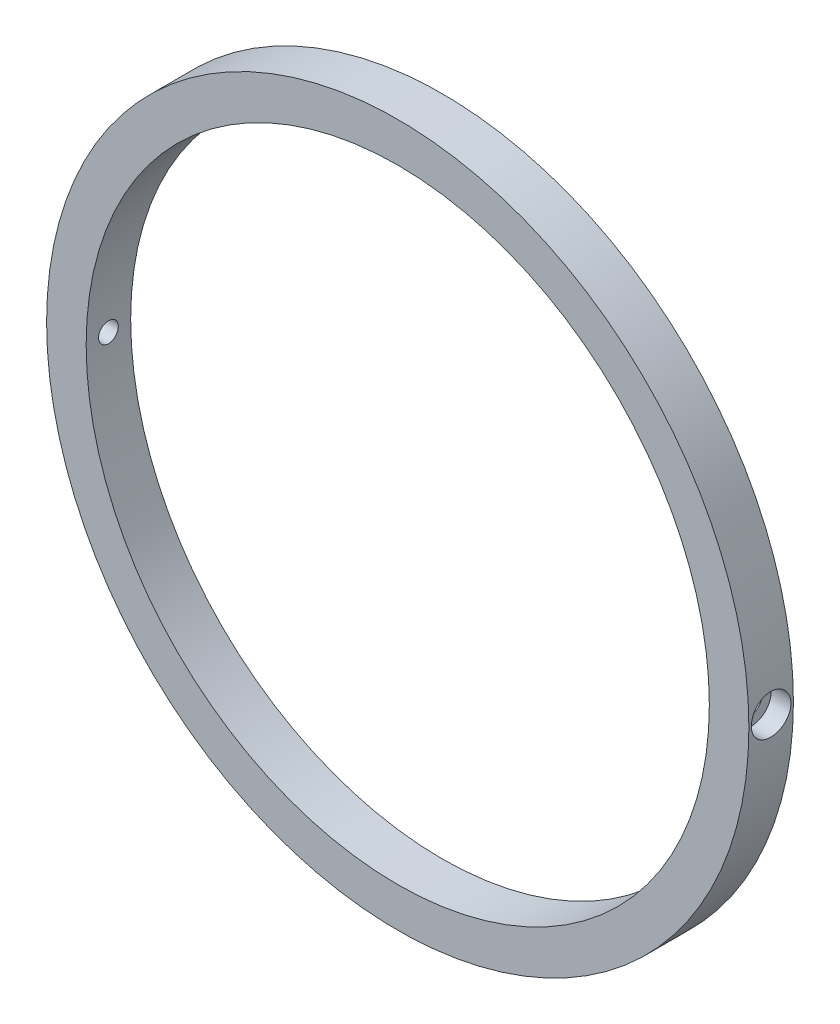
ISO-10303-21;
HEADER;
FILE_DESCRIPTION(('STEP AP214'),'2;1');
FILE_NAME('part.step','',(''),(''),'','','');
FILE_SCHEMA(('AUTOMOTIVE_DESIGN { 1 0 10303 214 1 1 1 1 }'));
ENDSEC;
DATA;
#1=APPLICATION_CONTEXT('core data for automotive mechanical design processes');
#2=APPLICATION_PROTOCOL_DEFINITION('international standard','automotive_design',2000,#1);
#3=PRODUCT_CONTEXT('',#1,'mechanical');
#4=PRODUCT('Part','Part','',(#3));
#5=PRODUCT_RELATED_PRODUCT_CATEGORY('part','',(#4));
#6=PRODUCT_DEFINITION_FORMATION('','',#4);
#7=PRODUCT_DEFINITION_CONTEXT('part definition',#1,'design');
#8=PRODUCT_DEFINITION('design','',#6,#7);
#9=PRODUCT_DEFINITION_SHAPE('','',#8);
#10=(LENGTH_UNIT() NAMED_UNIT(*) SI_UNIT(.MILLI.,.METRE.));
#11=(NAMED_UNIT(*) PLANE_ANGLE_UNIT() SI_UNIT($,.RADIAN.));
#12=(NAMED_UNIT(*) SI_UNIT($,.STERADIAN.) SOLID_ANGLE_UNIT());
#13=UNCERTAINTY_MEASURE_WITH_UNIT(LENGTH_MEASURE(1.E-05),#10,'distance_accuracy_value','');
#14=(GEOMETRIC_REPRESENTATION_CONTEXT(3) GLOBAL_UNCERTAINTY_ASSIGNED_CONTEXT((#13)) GLOBAL_UNIT_ASSIGNED_CONTEXT((#10,
#11,#12)) REPRESENTATION_CONTEXT('',''));
#15=CARTESIAN_POINT('',(0.,0.,0.));
#16=DIRECTION('',(0.,0.,1.));
#17=DIRECTION('',(1.,0.,0.));
#18=AXIS2_PLACEMENT_3D('',#15,#16,#17);
#19=CARTESIAN_POINT('',(0.,0.,3.571875));
#20=DIRECTION('',(0.,0.,1.));
#21=DIRECTION('',(1.,0.,0.));
#22=AXIS2_PLACEMENT_3D('',#19,#20,#21);
#23=PLANE('',#22);
#24=CARTESIAN_POINT('',(0.,0.,3.571875));
#25=DIRECTION('',(0.,0.,1.));
#26=DIRECTION('',(1.,0.,0.));
#27=AXIS2_PLACEMENT_3D('',#24,#25,#26);
#28=CIRCLE('',#27,56.35625);
#29=CARTESIAN_POINT('',(56.35625,0.,3.571875));
#30=VERTEX_POINT('',#29);
#31=EDGE_CURVE('E48',#30,#30,#28,.T.);
#32=ORIENTED_EDGE('',*,*,#31,.T.);
#33=EDGE_LOOP('',(#32));
#34=FACE_BOUND('',#33,.T.);
#35=CARTESIAN_POINT('',(0.,0.,3.571875));
#36=DIRECTION('',(0.,0.,1.));
#37=DIRECTION('',(1.,0.,0.));
#38=AXIS2_PLACEMENT_3D('',#35,#36,#37);
#39=CIRCLE('',#38,50.00625);
#40=CARTESIAN_POINT('',(50.00625,0.,3.571875));
#41=VERTEX_POINT('',#40);
#42=EDGE_CURVE('E85',#41,#41,#39,.T.);
#43=ORIENTED_EDGE('',*,*,#42,.F.);
#44=EDGE_LOOP('',(#43));
#45=FACE_BOUND('',#44,.T.);
#46=ADVANCED_FACE('F31',(#34,#45),#23,.T.);
#47=CARTESIAN_POINT('',(0.,0.,-3.571875));
#48=DIRECTION('',(0.,0.,1.));
#49=DIRECTION('',(1.,0.,0.));
#50=AXIS2_PLACEMENT_3D('',#47,#48,#49);
#51=PLANE('',#50);
#52=CARTESIAN_POINT('',(0.,0.,-3.571875));
#53=DIRECTION('',(0.,0.,1.));
#54=DIRECTION('',(1.,0.,0.));
#55=AXIS2_PLACEMENT_3D('',#52,#53,#54);
#56=CIRCLE('',#55,56.35625);
#57=CARTESIAN_POINT('',(56.35625,0.,-3.571875));
#58=VERTEX_POINT('',#57);
#59=EDGE_CURVE('E82',#58,#58,#56,.T.);
#60=ORIENTED_EDGE('',*,*,#59,.F.);
#61=EDGE_LOOP('',(#60));
#62=FACE_BOUND('',#61,.T.);
#63=CARTESIAN_POINT('',(0.,0.,-3.571875));
#64=DIRECTION('',(0.,0.,1.));
#65=DIRECTION('',(1.,0.,0.));
#66=AXIS2_PLACEMENT_3D('',#63,#64,#65);
#67=CIRCLE('',#66,50.00625);
#68=CARTESIAN_POINT('',(50.00625,0.,-3.571875));
#69=VERTEX_POINT('',#68);
#70=EDGE_CURVE('E88',#69,#69,#67,.T.);
#71=ORIENTED_EDGE('',*,*,#70,.T.);
#72=EDGE_LOOP('',(#71));
#73=FACE_BOUND('',#72,.T.);
#74=ADVANCED_FACE('F121',(#62,#73),#51,.F.);
#75=CARTESIAN_POINT('',(0.,0.,3.571875));
#76=DIRECTION('',(0.,0.,-1.));
#77=DIRECTION('',(-1.,0.,0.));
#78=AXIS2_PLACEMENT_3D('',#75,#76,#77);
#79=CYLINDRICAL_SURFACE('',#78,56.35625);
#80=CARTESIAN_POINT('',(-56.35625,0.,3.17500000000001));
#81=CARTESIAN_POINT('',(-56.3562488070639,-0.17818949688881,3.17499214710165));
#82=CARTESIAN_POINT('',(-56.3553958449006,-0.356504594019408,3.15994889918972));
#83=CARTESIAN_POINT('',(-56.3520752111119,-0.708213500618105,3.10015297713375));
#84=CARTESIAN_POINT('',(-56.3496056481155,-0.881601297065028,3.05536550230864));
#85=CARTESIAN_POINT('',(-56.3433312590257,-1.21831000970454,2.93736947652098));
#86=CARTESIAN_POINT('',(-56.3395271249721,-1.38163609188037,2.86417565354166));
#87=CARTESIAN_POINT('',(-56.3310117536249,-1.6936403251035,2.69146786978358));
#88=CARTESIAN_POINT('',(-56.3263007274676,-1.84232187343274,2.5919600332376));
#89=CARTESIAN_POINT('',(-56.316494779011,-2.12104498257764,2.36931230344307));
#90=CARTESIAN_POINT('',(-56.3113994426935,-2.25106598983634,2.24614669623539));
#91=CARTESIAN_POINT('',(-56.3014027001805,-2.48860170116661,1.97973193180977));
#92=CARTESIAN_POINT('',(-56.2965013020001,-2.5961154758525,1.83648194566012));
#93=CARTESIAN_POINT('',(-56.287442081059,-2.78564526010597,1.53385207243873));
#94=CARTESIAN_POINT('',(-56.2832847440704,-2.86764463780474,1.37446175343414));
#95=CARTESIAN_POINT('',(-56.276187688188,-3.00371142861824,1.04414899269456));
#96=CARTESIAN_POINT('',(-56.2732479582098,-3.0577790960087,0.873226655957057));
#97=CARTESIAN_POINT('',(-56.2689214846203,-3.13639181844436,0.524895913516286));
#98=CARTESIAN_POINT('',(-56.2675330798786,-3.16096845403026,0.347494656003137));
#99=CARTESIAN_POINT('',(-56.2664608457553,-3.1799989365961,-0.00892036426953428));
#100=CARTESIAN_POINT('',(-56.266777000118,-3.17445307084447,-0.187934111635015));
#101=CARTESIAN_POINT('',(-56.2690766886636,-3.13342222987491,-0.542277659603261));
#102=CARTESIAN_POINT('',(-56.2710583211965,-3.09797140010308,-0.717611428096159));
#103=CARTESIAN_POINT('',(-56.2764626370314,-2.99818988815397,-1.05983549025631));
#104=CARTESIAN_POINT('',(-56.2798853276448,-2.93385905945242,-1.22672574108013));
#105=CARTESIAN_POINT('',(-56.28778820836,-2.77810478046166,-1.54743523158331));
#106=CARTESIAN_POINT('',(-56.2922690043396,-2.68666580018644,-1.70124691350774));
#107=CARTESIAN_POINT('',(-56.301782489324,-2.47930211707277,-1.99135047557495));
#108=CARTESIAN_POINT('',(-56.3068151833311,-2.36337719229236,-2.1276421968978));
#109=CARTESIAN_POINT('',(-56.3168737188484,-2.11013979536505,-2.37903571723353));
#110=CARTESIAN_POINT('',(-56.3218995410553,-1.97279776332888,-2.49410774242748));
#111=CARTESIAN_POINT('',(-56.3313711693687,-1.6807285482427,-2.69956586020243));
#112=CARTESIAN_POINT('',(-56.3358169753058,-1.52600136011524,-2.78995194557369));
#113=CARTESIAN_POINT('',(-56.3436278259713,-1.20353624241053,-2.94346976195979));
#114=CARTESIAN_POINT('',(-56.3469928278114,-1.03579779685028,-3.00660041146258));
#115=CARTESIAN_POINT('',(-56.3522622549028,-0.692079529649505,-3.10379564317917));
#116=CARTESIAN_POINT('',(-56.3541666940222,-0.516099786276848,-3.13786050137269));
#117=CARTESIAN_POINT('',(-56.3562985935364,-0.161152745565784,-3.17592038392399));
#118=CARTESIAN_POINT('',(-56.356528350189,0.0178101236052269,-3.17995658253858));
#119=CARTESIAN_POINT('',(-56.3552910945924,0.373870482459747,-3.15795208695444));
#120=CARTESIAN_POINT('',(-56.3538240894957,0.550967980003289,-3.13191151954004));
#121=CARTESIAN_POINT('',(-56.3493599802967,0.898154778768988,-3.05052677311671));
#122=CARTESIAN_POINT('',(-56.3463638601651,1.06824851087377,-2.9952014377213));
#123=CARTESIAN_POINT('',(-56.3391787231727,1.39673606439549,-2.85683675795837));
#124=CARTESIAN_POINT('',(-56.3349896975863,1.55512980022052,-2.77379721087062));
#125=CARTESIAN_POINT('',(-56.3258840079501,1.85590996160087,-2.58225616645402));
#126=CARTESIAN_POINT('',(-56.3209665586711,1.99827881744892,-2.47372711699269));
#127=CARTESIAN_POINT('',(-56.3109602612623,2.26279113038791,-2.23432799097384));
#128=CARTESIAN_POINT('',(-56.3058714117522,2.38493442454348,-2.10345773445477));
#129=CARTESIAN_POINT('',(-56.2960892696843,2.60566744756069,-1.82291374483621));
#130=CARTESIAN_POINT('',(-56.2913964289456,2.70423050201445,-1.67321900632356));
#131=CARTESIAN_POINT('',(-56.2829426553753,2.8748228240502,-1.35938119563709));
#132=CARTESIAN_POINT('',(-56.2791817176743,2.94685223028114,-1.19523819896677));
#133=CARTESIAN_POINT('',(-56.2730191093007,3.06228624600497,-0.857261443967906));
#134=CARTESIAN_POINT('',(-56.2706166361869,3.10570775661077,-0.683433473334459));
#135=CARTESIAN_POINT('',(-56.2674396411002,3.16274864287058,-0.330940406362341));
#136=CARTESIAN_POINT('',(-56.2666651065766,3.17636824828272,-0.152275347326011));
#137=CARTESIAN_POINT('',(-56.2668316370321,3.17341654410086,0.204554893020812));
#138=CARTESIAN_POINT('',(-56.2677703182951,3.15688718287655,0.382720423963551));
#139=CARTESIAN_POINT('',(-56.2712524490683,3.09419359250235,0.733742356288986));
#140=CARTESIAN_POINT('',(-56.2737959015696,3.0480293081162,0.906598747775395));
#141=CARTESIAN_POINT('',(-56.2802003670135,2.92738534040244,1.24210313435494));
#142=CARTESIAN_POINT('',(-56.2840613814252,2.85290562550359,1.40475111806563));
#143=CARTESIAN_POINT('',(-56.2926657396009,2.67775138994934,1.71523814112231));
#144=CARTESIAN_POINT('',(-56.297409058317,2.57707761289294,1.86307760068882));
#145=CARTESIAN_POINT('',(-56.307251081107,2.35223989204021,2.13996236805013));
#146=CARTESIAN_POINT('',(-56.312350231966,2.22804606856848,2.26898339592115));
#147=CARTESIAN_POINT('',(-56.3223257160214,1.95972545380062,2.50438749642571));
#148=CARTESIAN_POINT('',(-56.3272019942404,1.81559377923535,2.61076500685149));
#149=CARTESIAN_POINT('',(-56.3361864336925,1.51135139323292,2.79792576700227));
#150=CARTESIAN_POINT('',(-56.3402937510033,1.35122341816128,2.87868096336929));
#151=CARTESIAN_POINT('',(-56.3472655200087,1.01977680676596,3.01206245819919));
#152=CARTESIAN_POINT('',(-56.3501314330254,0.848471602698058,3.06472184673471));
#153=CARTESIAN_POINT('',(-56.3535427929704,0.563424852165976,3.12666461907407));
#154=CARTESIAN_POINT('',(-56.3545535100039,0.451527829696537,3.1447671037977));
#155=CARTESIAN_POINT('',(-56.3559074922218,0.226437446906073,3.16893728298837));
#156=CARTESIAN_POINT('',(-56.3562507581421,0.113244088014252,3.17500499072241));
#157=CARTESIAN_POINT('',(-56.35625,0.,3.17500000000001));
#158=B_SPLINE_CURVE_WITH_KNOTS('',3,(#80,#81,#82,#83,#84,#85,#86,#87,#88,#89,#90,#91,#92,#93,
#94,#95,#96,#97,#98,#99,#100,#101,#102,#103,#104,#105,#106,#107,#108,#109,#110,#111,#112,#113,
#114,#115,#116,#117,#118,#119,#120,#121,#122,#123,#124,#125,#126,#127,#128,#129,#130,#131,#132,
#133,#134,#135,#136,#137,#138,#139,#140,#141,#142,#143,#144,#145,#146,#147,#148,#149,#150,#151,
#152,#153,#154,#155,#156,#157),.UNSPECIFIED.,.T.,.F.,(4,2,2,2,2,2,2,2,2,2,2,2,2,2,2,2,2,2,2,2,2,
2,2,2,2,2,2,2,2,2,2,2,2,2,2,2,2,2,4),(0.,0.534155095591571,1.06893625509694,1.6034405135268,
2.13782048259574,2.6727845973948,3.20777079798141,3.74310500872125,4.27843434597141,
4.81318991149801,5.3479403772448,5.88208109080971,6.41622451439748,6.95067453664025,
7.48512940337583,8.0203285623121,8.55552787755746,9.09074842788101,9.62596389622853,
10.1604453601958,10.6949245711406,11.2290602827551,11.7631999014797,12.2979195618366,
12.8326435296388,13.3679695569276,13.9032927868837,14.4382994716859,14.9733020318332,
15.507560773195,16.0418205103599,16.5760808432174,17.1103260111067,17.6452544886477,
18.1803142160465,18.7159577640561,19.2509690529669,19.5904389678501,19.9299085085054),.UNSPECIFIED.);
#159=CARTESIAN_POINT('',(-56.35625,0.,3.17500000000001));
#160=VERTEX_POINT('',#159);
#161=EDGE_CURVE('E10',#160,#160,#158,.T.);
#162=ORIENTED_EDGE('',*,*,#161,.T.);
#163=EDGE_LOOP('',(#162));
#164=FACE_BOUND('',#163,.T.);
#165=CARTESIAN_POINT('',(56.35625,0.,-3.17500000000001));
#166=CARTESIAN_POINT('',(56.3562488070639,-0.17818949688881,-3.17499214710165));
#167=CARTESIAN_POINT('',(56.3553958449006,-0.356504594019408,-3.15994889918972));
#168=CARTESIAN_POINT('',(56.3520752111119,-0.708213500618105,-3.10015297713375));
#169=CARTESIAN_POINT('',(56.3496056481155,-0.881601297065028,-3.05536550230864));
#170=CARTESIAN_POINT('',(56.3433312590257,-1.21831000970454,-2.93736947652098));
#171=CARTESIAN_POINT('',(56.3395271249721,-1.38163609188037,-2.86417565354166));
#172=CARTESIAN_POINT('',(56.3310117536249,-1.6936403251035,-2.69146786978358));
#173=CARTESIAN_POINT('',(56.3263007274676,-1.84232187343274,-2.5919600332376));
#174=CARTESIAN_POINT('',(56.316494779011,-2.12104498257764,-2.36931230344307));
#175=CARTESIAN_POINT('',(56.3113994426935,-2.25106598983634,-2.24614669623539));
#176=CARTESIAN_POINT('',(56.3014027001805,-2.48860170116661,-1.97973193180977));
#177=CARTESIAN_POINT('',(56.2965013020001,-2.5961154758525,-1.83648194566012));
#178=CARTESIAN_POINT('',(56.287442081059,-2.78564526010597,-1.53385207243873));
#179=CARTESIAN_POINT('',(56.2832847440704,-2.86764463780474,-1.37446175343414));
#180=CARTESIAN_POINT('',(56.276187688188,-3.00371142861824,-1.04414899269456));
#181=CARTESIAN_POINT('',(56.2732479582098,-3.0577790960087,-0.873226655957057));
#182=CARTESIAN_POINT('',(56.2689214846203,-3.13639181844436,-0.524895913516286));
#183=CARTESIAN_POINT('',(56.2675330798786,-3.16096845403026,-0.347494656003137));
#184=CARTESIAN_POINT('',(56.2664608457553,-3.1799989365961,0.00892036426953428));
#185=CARTESIAN_POINT('',(56.266777000118,-3.17445307084447,0.187934111635015));
#186=CARTESIAN_POINT('',(56.2690766886636,-3.13342222987491,0.542277659603261));
#187=CARTESIAN_POINT('',(56.2710583211965,-3.09797140010308,0.717611428096159));
#188=CARTESIAN_POINT('',(56.2764626370314,-2.99818988815397,1.05983549025631));
#189=CARTESIAN_POINT('',(56.2798853276448,-2.93385905945242,1.22672574108013));
#190=CARTESIAN_POINT('',(56.28778820836,-2.77810478046166,1.54743523158331));
#191=CARTESIAN_POINT('',(56.2922690043396,-2.68666580018644,1.70124691350774));
#192=CARTESIAN_POINT('',(56.301782489324,-2.47930211707277,1.99135047557495));
#193=CARTESIAN_POINT('',(56.3068151833311,-2.36337719229236,2.1276421968978));
#194=CARTESIAN_POINT('',(56.3168737188484,-2.11013979536505,2.37903571723353));
#195=CARTESIAN_POINT('',(56.3218995410553,-1.97279776332888,2.49410774242748));
#196=CARTESIAN_POINT('',(56.3313711693687,-1.6807285482427,2.69956586020243));
#197=CARTESIAN_POINT('',(56.3358169753058,-1.52600136011524,2.78995194557369));
#198=CARTESIAN_POINT('',(56.3436278259713,-1.20353624241053,2.94346976195979));
#199=CARTESIAN_POINT('',(56.3469928278114,-1.03579779685028,3.00660041146258));
#200=CARTESIAN_POINT('',(56.3522622549028,-0.692079529649505,3.10379564317917));
#201=CARTESIAN_POINT('',(56.3541666940222,-0.516099786276848,3.13786050137269));
#202=CARTESIAN_POINT('',(56.3562985935364,-0.161152745565784,3.17592038392399));
#203=CARTESIAN_POINT('',(56.356528350189,0.0178101236052269,3.17995658253858));
#204=CARTESIAN_POINT('',(56.3552910945924,0.373870482459747,3.15795208695444));
#205=CARTESIAN_POINT('',(56.3538240894957,0.550967980003289,3.13191151954004));
#206=CARTESIAN_POINT('',(56.3493599802967,0.898154778768988,3.05052677311671));
#207=CARTESIAN_POINT('',(56.3463638601651,1.06824851087377,2.9952014377213));
#208=CARTESIAN_POINT('',(56.3391787231727,1.39673606439549,2.85683675795837));
#209=CARTESIAN_POINT('',(56.3349896975863,1.55512980022052,2.77379721087062));
#210=CARTESIAN_POINT('',(56.3258840079501,1.85590996160087,2.58225616645402));
#211=CARTESIAN_POINT('',(56.3209665586711,1.99827881744892,2.47372711699269));
#212=CARTESIAN_POINT('',(56.3109602612623,2.26279113038791,2.23432799097384));
#213=CARTESIAN_POINT('',(56.3058714117522,2.38493442454348,2.10345773445477));
#214=CARTESIAN_POINT('',(56.2960892696843,2.60566744756069,1.82291374483621));
#215=CARTESIAN_POINT('',(56.2913964289456,2.70423050201445,1.67321900632356));
#216=CARTESIAN_POINT('',(56.2829426553753,2.8748228240502,1.35938119563709));
#217=CARTESIAN_POINT('',(56.2791817176743,2.94685223028114,1.19523819896677));
#218=CARTESIAN_POINT('',(56.2730191093007,3.06228624600497,0.857261443967906));
#219=CARTESIAN_POINT('',(56.2706166361869,3.10570775661077,0.683433473334459));
#220=CARTESIAN_POINT('',(56.2674396411002,3.16274864287058,0.330940406362341));
#221=CARTESIAN_POINT('',(56.2666651065766,3.17636824828272,0.152275347326011));
#222=CARTESIAN_POINT('',(56.2668316370321,3.17341654410086,-0.204554893020812));
#223=CARTESIAN_POINT('',(56.2677703182951,3.15688718287655,-0.382720423963551));
#224=CARTESIAN_POINT('',(56.2712524490683,3.09419359250235,-0.733742356288986));
#225=CARTESIAN_POINT('',(56.2737959015696,3.0480293081162,-0.906598747775395));
#226=CARTESIAN_POINT('',(56.2802003670135,2.92738534040244,-1.24210313435494));
#227=CARTESIAN_POINT('',(56.2840613814252,2.85290562550359,-1.40475111806563));
#228=CARTESIAN_POINT('',(56.2926657396009,2.67775138994934,-1.71523814112231));
#229=CARTESIAN_POINT('',(56.297409058317,2.57707761289294,-1.86307760068882));
#230=CARTESIAN_POINT('',(56.307251081107,2.35223989204021,-2.13996236805013));
#231=CARTESIAN_POINT('',(56.312350231966,2.22804606856848,-2.26898339592115));
#232=CARTESIAN_POINT('',(56.3223257160214,1.95972545380062,-2.50438749642571));
#233=CARTESIAN_POINT('',(56.3272019942404,1.81559377923535,-2.61076500685149));
#234=CARTESIAN_POINT('',(56.3361864336925,1.51135139323292,-2.79792576700227));
#235=CARTESIAN_POINT('',(56.3402937510033,1.35122341816128,-2.87868096336929));
#236=CARTESIAN_POINT('',(56.3472655200087,1.01977680676596,-3.01206245819919));
#237=CARTESIAN_POINT('',(56.3501314330254,0.848471602698058,-3.06472184673471));
#238=CARTESIAN_POINT('',(56.3535427929704,0.563424852165976,-3.12666461907407));
#239=CARTESIAN_POINT('',(56.3545535100039,0.451527829696537,-3.1447671037977));
#240=CARTESIAN_POINT('',(56.3559074922218,0.226437446906073,-3.16893728298837));
#241=CARTESIAN_POINT('',(56.3562507581421,0.113244088014252,-3.17500499072241));
#242=CARTESIAN_POINT('',(56.35625,0.,-3.17500000000001));
#243=B_SPLINE_CURVE_WITH_KNOTS('',3,(#165,#166,#167,#168,#169,#170,#171,#172,#173,#174,#175,
#176,#177,#178,#179,#180,#181,#182,#183,#184,#185,#186,#187,#188,#189,#190,#191,#192,#193,#194,
#195,#196,#197,#198,#199,#200,#201,#202,#203,#204,#205,#206,#207,#208,#209,#210,#211,#212,#213,
#214,#215,#216,#217,#218,#219,#220,#221,#222,#223,#224,#225,#226,#227,#228,#229,#230,#231,#232,
#233,#234,#235,#236,#237,#238,#239,#240,#241,#242),.UNSPECIFIED.,.T.,.F.,(4,2,2,2,2,2,2,2,2,2,2,
2,2,2,2,2,2,2,2,2,2,2,2,2,2,2,2,2,2,2,2,2,2,2,2,2,2,2,4),(0.,0.534155095591571,1.06893625509694,
1.6034405135268,2.13782048259574,2.6727845973948,3.20777079798141,3.74310500872125,
4.27843434597141,4.81318991149801,5.3479403772448,5.88208109080971,6.41622451439748,
6.95067453664025,7.48512940337583,8.0203285623121,8.55552787755746,9.09074842788101,
9.62596389622853,10.1604453601958,10.6949245711406,11.2290602827551,11.7631999014797,
12.2979195618366,12.8326435296388,13.3679695569276,13.9032927868837,14.4382994716859,
14.9733020318332,15.507560773195,16.0418205103599,16.5760808432174,17.1103260111067,
17.6452544886477,18.1803142160465,18.7159577640561,19.2509690529669,19.5904389678501,
19.9299085085054),.UNSPECIFIED.);
#244=CARTESIAN_POINT('',(56.35625,0.,-3.17500000000001));
#245=VERTEX_POINT('',#244);
#246=EDGE_CURVE('E44',#245,#245,#243,.T.);
#247=ORIENTED_EDGE('',*,*,#246,.T.);
#248=EDGE_LOOP('',(#247));
#249=FACE_BOUND('',#248,.T.);
#250=ORIENTED_EDGE('',*,*,#31,.F.);
#251=EDGE_LOOP('',(#250));
#252=FACE_BOUND('',#251,.T.);
#253=ORIENTED_EDGE('',*,*,#59,.T.);
#254=EDGE_LOOP('',(#253));
#255=FACE_BOUND('',#254,.T.);
#256=ADVANCED_FACE('F33',(#164,#249,#252,#255),#79,.T.);
#257=CARTESIAN_POINT('',(0.,0.,3.571875));
#258=DIRECTION('',(0.,0.,-1.));
#259=DIRECTION('',(-1.,0.,0.));
#260=AXIS2_PLACEMENT_3D('',#257,#258,#259);
#261=CYLINDRICAL_SURFACE('',#260,50.00625);
#262=CARTESIAN_POINT('',(-50.00625,0.,1.58750000000001));
#263=CARTESIAN_POINT('',(-50.0062496606678,-0.0891464758756064,1.58749605411074));
#264=CARTESIAN_POINT('',(-50.0060090599656,-0.17835701947236,1.57996572864602));
#265=CARTESIAN_POINT('',(-50.0050723859316,-0.354319549300116,1.55003118905528));
#266=CARTESIAN_POINT('',(-50.0043757690484,-0.441068472478699,1.5276092242779));
#267=CARTESIAN_POINT('',(-50.0026059496477,-0.609533149037438,1.46853183352871));
#268=CARTESIAN_POINT('',(-50.001532931897,-0.691251348794443,1.43188339007926));
#269=CARTESIAN_POINT('',(-49.9991313322757,-0.847352879093743,1.34540342077517));
#270=CARTESIAN_POINT('',(-49.9978028126741,-0.921737990137952,1.29557510591914));
#271=CARTESIAN_POINT('',(-49.9950390565054,-1.06112135523349,1.18412120966111));
#272=CARTESIAN_POINT('',(-49.9936037754418,-1.1261156617734,1.12249069226137));
#273=CARTESIAN_POINT('',(-49.990788652989,-1.24483920456133,0.989190633561183));
#274=CARTESIAN_POINT('',(-49.9894088138132,-1.29856799139625,0.917520691950196));
#275=CARTESIAN_POINT('',(-49.9868599423832,-1.39324215090916,0.76616073814534));
#276=CARTESIAN_POINT('',(-49.9856909508258,-1.4341850568338,0.686469182274863));
#277=CARTESIAN_POINT('',(-49.983696024334,-1.50210921825029,0.5213391345159));
#278=CARTESIAN_POINT('',(-49.9828700879411,-1.52909053310219,0.435900667063115));
#279=CARTESIAN_POINT('',(-49.9816547380432,-1.5683168605707,0.26173278865917));
#280=CARTESIAN_POINT('',(-49.9812651763856,-1.58056687468321,0.173004505202146));
#281=CARTESIAN_POINT('',(-49.9809660556091,-1.58999827746116,-0.00524987483905296));
#282=CARTESIAN_POINT('',(-49.981056494448,-1.58717973023571,-0.094775968027332));
#283=CARTESIAN_POINT('',(-49.9817070381154,-1.56655823993009,-0.272050716584522));
#284=CARTESIAN_POINT('',(-49.9822669734946,-1.54876070301428,-0.359800001533351));
#285=CARTESIAN_POINT('',(-49.9837931228936,-1.49869480387451,-0.53106470959484));
#286=CARTESIAN_POINT('',(-49.9847593378633,-1.46642640781424,-0.614580122807193));
#287=CARTESIAN_POINT('',(-49.9869893227469,-1.38832857064622,-0.775023782349933));
#288=CARTESIAN_POINT('',(-49.9882531470025,-1.34249665251613,-0.851950822174746));
#289=CARTESIAN_POINT('',(-49.9909358244751,-1.23857461024007,-0.997020820813465));
#290=CARTESIAN_POINT('',(-49.992354678096,-1.18048445414088,-1.06516375672935));
#291=CARTESIAN_POINT('',(-49.9951882233423,-1.05366432677087,-1.19076271066185));
#292=CARTESIAN_POINT('',(-49.9966029128529,-0.984929668108263,-1.24821399586668));
#293=CARTESIAN_POINT('',(-49.9992680489337,-0.838788195945105,-1.35076237038462));
#294=CARTESIAN_POINT('',(-50.0005184954764,-0.761381380999442,-1.39585945763904));
#295=CARTESIAN_POINT('',(-50.0027142083498,-0.600090261827105,-1.47241876557773));
#296=CARTESIAN_POINT('',(-50.0036594713251,-0.516205886396874,-1.50388083635609));
#297=CARTESIAN_POINT('',(-50.0051382094865,-0.344342014317202,-1.55227398802325));
#298=CARTESIAN_POINT('',(-50.0056716859257,-0.256362530129728,-1.56920511312862));
#299=CARTESIAN_POINT('',(-50.0062665556241,-0.0788469888931259,-1.5880499573177));
#300=CARTESIAN_POINT('',(-50.0063281547373,0.0106883723253743,-1.58997022481634));
#301=CARTESIAN_POINT('',(-50.0059728715501,0.188810192321874,-1.57875591082616));
#302=CARTESIAN_POINT('',(-50.0055559898733,0.277396652336449,-1.56562134895871));
#303=CARTESIAN_POINT('',(-50.0042908589417,0.45108775043896,-1.52467563923256));
#304=CARTESIAN_POINT('',(-50.0034426971098,0.536193090392839,-1.49686746575152));
#305=CARTESIAN_POINT('',(-50.0014105752657,0.700527663257228,-1.42736692592976));
#306=CARTESIAN_POINT('',(-50.0002266144938,0.779756882871417,-1.38567452817339));
#307=CARTESIAN_POINT('',(-49.9976557441868,0.93012031629183,-1.28957218283098));
#308=CARTESIAN_POINT('',(-49.9962687644039,1.00125171291853,-1.23515782934191));
#309=CARTESIAN_POINT('',(-49.9934483953353,1.13337204100328,-1.115162665653));
#310=CARTESIAN_POINT('',(-49.992015005919,1.19436094391871,-1.0495818240299));
#311=CARTESIAN_POINT('',(-49.9892628198659,1.30448690664614,-0.909087219149338));
#312=CARTESIAN_POINT('',(-49.9879440641987,1.35361974019289,-0.834170142245608));
#313=CARTESIAN_POINT('',(-49.9855704760149,1.43860996686264,-0.677146589295761));
#314=CARTESIAN_POINT('',(-49.9845156428662,1.47446739178231,-0.595040130469917));
#315=CARTESIAN_POINT('',(-49.9827891240416,1.53188153805616,-0.425984410056498));
#316=CARTESIAN_POINT('',(-49.9821173651733,1.55344099139532,-0.339036077073699));
#317=CARTESIAN_POINT('',(-49.981232529399,1.58165615507506,-0.162751609297307));
#318=CARTESIAN_POINT('',(-49.9810194519416,1.58831188333305,-0.0734154773744828));
#319=CARTESIAN_POINT('',(-49.9810760294393,1.5865303523533,0.105066386137394));
#320=CARTESIAN_POINT('',(-49.9813454712691,1.57809975663334,0.194212184383915));
#321=CARTESIAN_POINT('',(-49.9823362649838,1.54639860208068,0.369822394692191));
#322=CARTESIAN_POINT('',(-49.9830576177626,1.52312801389155,0.45628680144927));
#323=CARTESIAN_POINT('',(-49.9848708815458,1.46240842148503,0.624082206364002));
#324=CARTESIAN_POINT('',(-49.9859627985938,1.4249591860231,0.705413120772483));
#325=CARTESIAN_POINT('',(-49.9883940533906,1.33694745543663,0.860631803192841));
#326=CARTESIAN_POINT('',(-49.9897333822831,1.2863854296674,0.934519837481553));
#327=CARTESIAN_POINT('',(-49.9925090890204,1.17356307667012,1.07278640406187));
#328=CARTESIAN_POINT('',(-49.993945499228,1.11129883597633,1.13716174220688));
#329=CARTESIAN_POINT('',(-49.9967534718495,0.976828440012258,1.25456346757841));
#330=CARTESIAN_POINT('',(-49.9981250181254,0.904619827900184,1.30758704195943));
#331=CARTESIAN_POINT('',(-50.0006491657392,0.752280281347614,1.40079015412929));
#332=CARTESIAN_POINT('',(-50.0018016200137,0.672144080059608,1.44096107695945));
#333=CARTESIAN_POINT('',(-50.0037550857224,0.506322845803257,1.50723171466333));
#334=CARTESIAN_POINT('',(-50.0045565157613,0.420644562673647,1.5333481983386));
#335=CARTESIAN_POINT('',(-50.0055035840054,0.278688046319331,1.56385225875828));
#336=CARTESIAN_POINT('',(-50.0057822744526,0.223331099898494,1.57270899252512));
#337=CARTESIAN_POINT('',(-50.0061555890159,0.111991198575292,1.58453410171809));
#338=CARTESIAN_POINT('',(-50.0062502131929,0.0560082438800253,1.58750247909216));
#339=CARTESIAN_POINT('',(-50.00625,0.,1.58750000000001));
#340=B_SPLINE_CURVE_WITH_KNOTS('',3,(#262,#263,#264,#265,#266,#267,#268,#269,#270,#271,#272,
#273,#274,#275,#276,#277,#278,#279,#280,#281,#282,#283,#284,#285,#286,#287,#288,#289,#290,#291,
#292,#293,#294,#295,#296,#297,#298,#299,#300,#301,#302,#303,#304,#305,#306,#307,#308,#309,#310,
#311,#312,#313,#314,#315,#316,#317,#318,#319,#320,#321,#322,#323,#324,#325,#326,#327,#328,#329,
#330,#331,#332,#333,#334,#335,#336,#337,#338,#339),.UNSPECIFIED.,.T.,.F.,(4,2,2,2,2,2,2,2,2,2,2,
2,2,2,2,2,2,2,2,2,2,2,2,2,2,2,2,2,2,2,2,2,2,2,2,2,2,2,4),(0.,0.267234989346009,
0.534789092595322,0.802212042854265,1.06956990104653,1.33703982063916,1.60452040832586,
1.87205256864944,2.13958359150599,2.40702375793037,2.67446278653279,2.94180533335154,
3.20914850528405,3.47654053061062,3.74393325294915,4.01144406039861,4.27895491242566,
4.54646870544216,4.81398168443152,5.08137795564536,5.34877387835491,5.61611562005409,
5.88345796666826,6.15089303753424,6.41832886099342,6.68585987540985,6.95339024904364,
7.22086948957079,7.48834840853138,7.75570921319021,8.0230705467431,8.29043624097373,
8.55779236651677,8.82523806115402,9.09274994946428,9.36044077354374,9.6278114949856,
9.79570783929947,9.96360412807092),.UNSPECIFIED.);
#341=CARTESIAN_POINT('',(-50.00625,0.,1.58750000000001));
#342=VERTEX_POINT('',#341);
#343=EDGE_CURVE('E36',#342,#342,#340,.T.);
#344=ORIENTED_EDGE('',*,*,#343,.F.);
#345=EDGE_LOOP('',(#344));
#346=FACE_BOUND('',#345,.T.);
#347=CARTESIAN_POINT('',(50.00625,0.,-1.58750000000001));
#348=CARTESIAN_POINT('',(50.0062496606678,-0.0891464758756064,-1.58749605411074));
#349=CARTESIAN_POINT('',(50.0060090599656,-0.17835701947236,-1.57996572864602));
#350=CARTESIAN_POINT('',(50.0050723859316,-0.354319549300116,-1.55003118905528));
#351=CARTESIAN_POINT('',(50.0043757690484,-0.441068472478699,-1.5276092242779));
#352=CARTESIAN_POINT('',(50.0026059496477,-0.609533149037438,-1.46853183352871));
#353=CARTESIAN_POINT('',(50.001532931897,-0.691251348794443,-1.43188339007926));
#354=CARTESIAN_POINT('',(49.9991313322757,-0.847352879093743,-1.34540342077517));
#355=CARTESIAN_POINT('',(49.9978028126741,-0.921737990137952,-1.29557510591914));
#356=CARTESIAN_POINT('',(49.9950390565054,-1.06112135523349,-1.18412120966111));
#357=CARTESIAN_POINT('',(49.9936037754418,-1.1261156617734,-1.12249069226137));
#358=CARTESIAN_POINT('',(49.990788652989,-1.24483920456133,-0.989190633561183));
#359=CARTESIAN_POINT('',(49.9894088138132,-1.29856799139625,-0.917520691950196));
#360=CARTESIAN_POINT('',(49.9868599423832,-1.39324215090916,-0.76616073814534));
#361=CARTESIAN_POINT('',(49.9856909508258,-1.4341850568338,-0.686469182274863));
#362=CARTESIAN_POINT('',(49.983696024334,-1.50210921825029,-0.5213391345159));
#363=CARTESIAN_POINT('',(49.9828700879411,-1.52909053310219,-0.435900667063115));
#364=CARTESIAN_POINT('',(49.9816547380432,-1.5683168605707,-0.26173278865917));
#365=CARTESIAN_POINT('',(49.9812651763856,-1.58056687468321,-0.173004505202146));
#366=CARTESIAN_POINT('',(49.9809660556091,-1.58999827746116,0.00524987483905296));
#367=CARTESIAN_POINT('',(49.981056494448,-1.58717973023571,0.094775968027332));
#368=CARTESIAN_POINT('',(49.9817070381154,-1.56655823993009,0.272050716584522));
#369=CARTESIAN_POINT('',(49.9822669734946,-1.54876070301428,0.359800001533351));
#370=CARTESIAN_POINT('',(49.9837931228936,-1.49869480387451,0.53106470959484));
#371=CARTESIAN_POINT('',(49.9847593378633,-1.46642640781424,0.614580122807193));
#372=CARTESIAN_POINT('',(49.9869893227469,-1.38832857064622,0.775023782349933));
#373=CARTESIAN_POINT('',(49.9882531470025,-1.34249665251613,0.851950822174746));
#374=CARTESIAN_POINT('',(49.9909358244751,-1.23857461024007,0.997020820813465));
#375=CARTESIAN_POINT('',(49.992354678096,-1.18048445414088,1.06516375672935));
#376=CARTESIAN_POINT('',(49.9951882233423,-1.05366432677087,1.19076271066185));
#377=CARTESIAN_POINT('',(49.9966029128529,-0.984929668108263,1.24821399586668));
#378=CARTESIAN_POINT('',(49.9992680489337,-0.838788195945105,1.35076237038462));
#379=CARTESIAN_POINT('',(50.0005184954764,-0.761381380999442,1.39585945763904));
#380=CARTESIAN_POINT('',(50.0027142083498,-0.600090261827105,1.47241876557773));
#381=CARTESIAN_POINT('',(50.0036594713251,-0.516205886396874,1.50388083635609));
#382=CARTESIAN_POINT('',(50.0051382094865,-0.344342014317202,1.55227398802325));
#383=CARTESIAN_POINT('',(50.0056716859257,-0.256362530129728,1.56920511312862));
#384=CARTESIAN_POINT('',(50.0062665556241,-0.0788469888931259,1.5880499573177));
#385=CARTESIAN_POINT('',(50.0063281547373,0.0106883723253743,1.58997022481634));
#386=CARTESIAN_POINT('',(50.0059728715501,0.188810192321874,1.57875591082616));
#387=CARTESIAN_POINT('',(50.0055559898733,0.277396652336449,1.56562134895871));
#388=CARTESIAN_POINT('',(50.0042908589417,0.45108775043896,1.52467563923256));
#389=CARTESIAN_POINT('',(50.0034426971098,0.536193090392839,1.49686746575152));
#390=CARTESIAN_POINT('',(50.0014105752657,0.700527663257228,1.42736692592976));
#391=CARTESIAN_POINT('',(50.0002266144938,0.779756882871417,1.38567452817339));
#392=CARTESIAN_POINT('',(49.9976557441868,0.93012031629183,1.28957218283098));
#393=CARTESIAN_POINT('',(49.9962687644039,1.00125171291853,1.23515782934191));
#394=CARTESIAN_POINT('',(49.9934483953353,1.13337204100328,1.115162665653));
#395=CARTESIAN_POINT('',(49.992015005919,1.19436094391871,1.0495818240299));
#396=CARTESIAN_POINT('',(49.9892628198659,1.30448690664614,0.909087219149338));
#397=CARTESIAN_POINT('',(49.9879440641987,1.35361974019289,0.834170142245608));
#398=CARTESIAN_POINT('',(49.9855704760149,1.43860996686264,0.677146589295761));
#399=CARTESIAN_POINT('',(49.9845156428662,1.47446739178231,0.595040130469917));
#400=CARTESIAN_POINT('',(49.9827891240416,1.53188153805616,0.425984410056498));
#401=CARTESIAN_POINT('',(49.9821173651733,1.55344099139532,0.339036077073699));
#402=CARTESIAN_POINT('',(49.981232529399,1.58165615507506,0.162751609297307));
#403=CARTESIAN_POINT('',(49.9810194519416,1.58831188333305,0.0734154773744828));
#404=CARTESIAN_POINT('',(49.9810760294393,1.5865303523533,-0.105066386137394));
#405=CARTESIAN_POINT('',(49.9813454712691,1.57809975663334,-0.194212184383915));
#406=CARTESIAN_POINT('',(49.9823362649838,1.54639860208068,-0.369822394692191));
#407=CARTESIAN_POINT('',(49.9830576177626,1.52312801389155,-0.45628680144927));
#408=CARTESIAN_POINT('',(49.9848708815458,1.46240842148503,-0.624082206364002));
#409=CARTESIAN_POINT('',(49.9859627985938,1.4249591860231,-0.705413120772483));
#410=CARTESIAN_POINT('',(49.9883940533906,1.33694745543663,-0.860631803192841));
#411=CARTESIAN_POINT('',(49.9897333822831,1.2863854296674,-0.934519837481553));
#412=CARTESIAN_POINT('',(49.9925090890204,1.17356307667012,-1.07278640406187));
#413=CARTESIAN_POINT('',(49.993945499228,1.11129883597633,-1.13716174220688));
#414=CARTESIAN_POINT('',(49.9967534718495,0.976828440012258,-1.25456346757841));
#415=CARTESIAN_POINT('',(49.9981250181254,0.904619827900184,-1.30758704195943));
#416=CARTESIAN_POINT('',(50.0006491657392,0.752280281347614,-1.40079015412929));
#417=CARTESIAN_POINT('',(50.0018016200137,0.672144080059608,-1.44096107695945));
#418=CARTESIAN_POINT('',(50.0037550857224,0.506322845803257,-1.50723171466333));
#419=CARTESIAN_POINT('',(50.0045565157613,0.420644562673647,-1.5333481983386));
#420=CARTESIAN_POINT('',(50.0055035840054,0.278688046319331,-1.56385225875828));
#421=CARTESIAN_POINT('',(50.0057822744526,0.223331099898494,-1.57270899252512));
#422=CARTESIAN_POINT('',(50.0061555890159,0.111991198575292,-1.58453410171809));
#423=CARTESIAN_POINT('',(50.0062502131929,0.0560082438800253,-1.58750247909216));
#424=CARTESIAN_POINT('',(50.00625,0.,-1.58750000000001));
#425=B_SPLINE_CURVE_WITH_KNOTS('',3,(#347,#348,#349,#350,#351,#352,#353,#354,#355,#356,#357,
#358,#359,#360,#361,#362,#363,#364,#365,#366,#367,#368,#369,#370,#371,#372,#373,#374,#375,#376,
#377,#378,#379,#380,#381,#382,#383,#384,#385,#386,#387,#388,#389,#390,#391,#392,#393,#394,#395,
#396,#397,#398,#399,#400,#401,#402,#403,#404,#405,#406,#407,#408,#409,#410,#411,#412,#413,#414,
#415,#416,#417,#418,#419,#420,#421,#422,#423,#424),.UNSPECIFIED.,.T.,.F.,(4,2,2,2,2,2,2,2,2,2,2,
2,2,2,2,2,2,2,2,2,2,2,2,2,2,2,2,2,2,2,2,2,2,2,2,2,2,2,4),(0.,0.267234989346009,
0.534789092595322,0.802212042854265,1.06956990104653,1.33703982063916,1.60452040832586,
1.87205256864944,2.13958359150599,2.40702375793037,2.67446278653279,2.94180533335154,
3.20914850528405,3.47654053061062,3.74393325294915,4.01144406039861,4.27895491242566,
4.54646870544216,4.81398168443152,5.08137795564536,5.34877387835491,5.61611562005409,
5.88345796666826,6.15089303753424,6.41832886099342,6.68585987540985,6.95339024904364,
7.22086948957079,7.48834840853138,7.75570921319021,8.0230705467431,8.29043624097373,
8.55779236651677,8.82523806115402,9.09274994946428,9.36044077354374,9.6278114949856,
9.79570783929947,9.96360412807092),.UNSPECIFIED.);
#426=CARTESIAN_POINT('',(50.00625,0.,-1.58750000000001));
#427=VERTEX_POINT('',#426);
#428=EDGE_CURVE('E54',#427,#427,#425,.T.);
#429=ORIENTED_EDGE('',*,*,#428,.F.);
#430=EDGE_LOOP('',(#429));
#431=FACE_BOUND('',#430,.T.);
#432=ORIENTED_EDGE('',*,*,#42,.T.);
#433=EDGE_LOOP('',(#432));
#434=FACE_BOUND('',#433,.T.);
#435=ORIENTED_EDGE('',*,*,#70,.F.);
#436=EDGE_LOOP('',(#435));
#437=FACE_BOUND('',#436,.T.);
#438=ADVANCED_FACE('F77',(#346,#431,#434,#437),#261,.F.);
#439=CARTESIAN_POINT('',(56.35625,0.,0.));
#440=DIRECTION('',(1.,0.,0.));
#441=DIRECTION('',(0.,0.,-1.));
#442=AXIS2_PLACEMENT_3D('',#439,#440,#441);
#443=CYLINDRICAL_SURFACE('',#442,3.17500000000001);
#444=CARTESIAN_POINT('',(53.18125,0.,0.));
#445=DIRECTION('',(1.,0.,0.));
#446=DIRECTION('',(0.,0.,-1.));
#447=AXIS2_PLACEMENT_3D('',#444,#445,#446);
#448=CIRCLE('',#447,3.17500000000001);
#449=CARTESIAN_POINT('',(53.18125,0.,-3.17500000000001));
#450=VERTEX_POINT('',#449);
#451=EDGE_CURVE('E96',#450,#450,#448,.T.);
#452=ORIENTED_EDGE('',*,*,#451,.F.);
#453=EDGE_LOOP('',(#452));
#454=FACE_BOUND('',#453,.T.);
#455=ORIENTED_EDGE('',*,*,#246,.F.);
#456=EDGE_LOOP('',(#455));
#457=FACE_BOUND('',#456,.T.);
#458=ADVANCED_FACE('F72',(#454,#457),#443,.F.);
#459=CARTESIAN_POINT('',(56.35625,0.,0.));
#460=DIRECTION('',(1.,0.,0.));
#461=DIRECTION('',(0.,0.,-1.));
#462=AXIS2_PLACEMENT_3D('',#459,#460,#461);
#463=CYLINDRICAL_SURFACE('',#462,1.58750000000001);
#464=ORIENTED_EDGE('',*,*,#428,.T.);
#465=EDGE_LOOP('',(#464));
#466=FACE_BOUND('',#465,.T.);
#467=CARTESIAN_POINT('',(53.18125,0.,0.));
#468=DIRECTION('',(1.,0.,0.));
#469=DIRECTION('',(0.,0.,-1.));
#470=AXIS2_PLACEMENT_3D('',#467,#468,#469);
#471=CIRCLE('',#470,1.58750000000001);
#472=CARTESIAN_POINT('',(53.18125,0.,-1.58750000000001));
#473=VERTEX_POINT('',#472);
#474=EDGE_CURVE('E93',#473,#473,#471,.T.);
#475=ORIENTED_EDGE('',*,*,#474,.T.);
#476=EDGE_LOOP('',(#475));
#477=FACE_BOUND('',#476,.T.);
#478=ADVANCED_FACE('F76',(#466,#477),#463,.F.);
#479=CARTESIAN_POINT('',(53.18125,1.58750000000001,0.));
#480=DIRECTION('',(-1.,0.,0.));
#481=DIRECTION('',(0.,0.,1.));
#482=AXIS2_PLACEMENT_3D('',#479,#480,#481);
#483=PLANE('',#482);
#484=ORIENTED_EDGE('',*,*,#474,.F.);
#485=EDGE_LOOP('',(#484));
#486=FACE_BOUND('',#485,.T.);
#487=ORIENTED_EDGE('',*,*,#451,.T.);
#488=EDGE_LOOP('',(#487));
#489=FACE_BOUND('',#488,.T.);
#490=ADVANCED_FACE('F63',(#486,#489),#483,.F.);
#491=CARTESIAN_POINT('',(-56.35625,0.,0.));
#492=DIRECTION('',(-1.,0.,0.));
#493=DIRECTION('',(0.,0.,1.));
#494=AXIS2_PLACEMENT_3D('',#491,#492,#493);
#495=CYLINDRICAL_SURFACE('',#494,3.17500000000001);
#496=CARTESIAN_POINT('',(-53.18125,0.,0.));
#497=DIRECTION('',(-1.,0.,0.));
#498=DIRECTION('',(0.,0.,1.));
#499=AXIS2_PLACEMENT_3D('',#496,#497,#498);
#500=CIRCLE('',#499,3.17500000000001);
#501=CARTESIAN_POINT('',(-53.18125,0.,3.17500000000001));
#502=VERTEX_POINT('',#501);
#503=EDGE_CURVE('E102',#502,#502,#500,.T.);
#504=ORIENTED_EDGE('',*,*,#503,.F.);
#505=EDGE_LOOP('',(#504));
#506=FACE_BOUND('',#505,.T.);
#507=ORIENTED_EDGE('',*,*,#161,.F.);
#508=EDGE_LOOP('',(#507));
#509=FACE_BOUND('',#508,.T.);
#510=ADVANCED_FACE('F58',(#506,#509),#495,.F.);
#511=CARTESIAN_POINT('',(-56.35625,0.,0.));
#512=DIRECTION('',(-1.,0.,0.));
#513=DIRECTION('',(0.,0.,1.));
#514=AXIS2_PLACEMENT_3D('',#511,#512,#513);
#515=CYLINDRICAL_SURFACE('',#514,1.58750000000001);
#516=ORIENTED_EDGE('',*,*,#343,.T.);
#517=EDGE_LOOP('',(#516));
#518=FACE_BOUND('',#517,.T.);
#519=CARTESIAN_POINT('',(-53.18125,0.,0.));
#520=DIRECTION('',(-1.,0.,0.));
#521=DIRECTION('',(0.,0.,1.));
#522=AXIS2_PLACEMENT_3D('',#519,#520,#521);
#523=CIRCLE('',#522,1.58750000000001);
#524=CARTESIAN_POINT('',(-53.18125,0.,1.58750000000001));
#525=VERTEX_POINT('',#524);
#526=EDGE_CURVE('E99',#525,#525,#523,.T.);
#527=ORIENTED_EDGE('',*,*,#526,.T.);
#528=EDGE_LOOP('',(#527));
#529=FACE_BOUND('',#528,.T.);
#530=ADVANCED_FACE('F62',(#518,#529),#515,.F.);
#531=CARTESIAN_POINT('',(-53.18125,1.58750000000001,0.));
#532=DIRECTION('',(1.,0.,0.));
#533=DIRECTION('',(0.,0.,-1.));
#534=AXIS2_PLACEMENT_3D('',#531,#532,#533);
#535=PLANE('',#534);
#536=ORIENTED_EDGE('',*,*,#526,.F.);
#537=EDGE_LOOP('',(#536));
#538=FACE_BOUND('',#537,.T.);
#539=ORIENTED_EDGE('',*,*,#503,.T.);
#540=EDGE_LOOP('',(#539));
#541=FACE_BOUND('',#540,.T.);
#542=ADVANCED_FACE('F65',(#538,#541),#535,.F.);
#543=CLOSED_SHELL('',(#46,#74,#256,#438,#458,#478,#490,#510,#530,#542));
#544=MANIFOLD_SOLID_BREP('B2',#543);
#545=ADVANCED_BREP_SHAPE_REPRESENTATION('',(#18,#544),#14);
#546=SHAPE_DEFINITION_REPRESENTATION(#9,#545);
ENDSEC;
END-ISO-10303-21;
